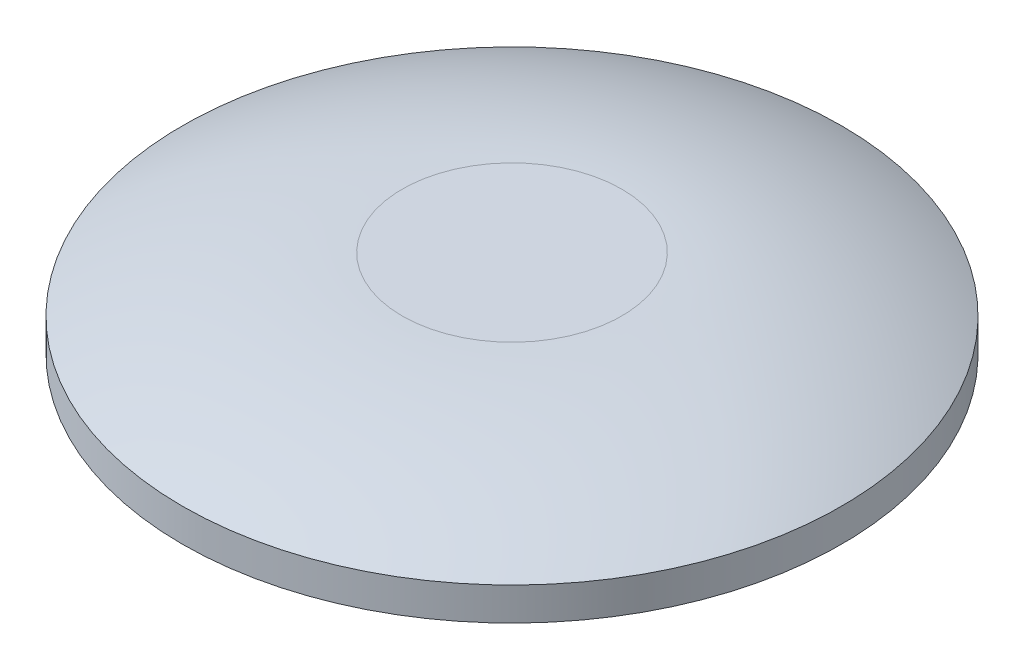
ISO-10303-21;
HEADER;
FILE_DESCRIPTION(('STEP AP214'),'2;1');
FILE_NAME('part.step','',(''),(''),'','','');
FILE_SCHEMA(('AUTOMOTIVE_DESIGN { 1 0 10303 214 1 1 1 1 }'));
ENDSEC;
DATA;
#1=APPLICATION_CONTEXT('core data for automotive mechanical design processes');
#2=APPLICATION_PROTOCOL_DEFINITION('international standard','automotive_design',2000,#1);
#3=PRODUCT_CONTEXT('',#1,'mechanical');
#4=PRODUCT('Part','Part','',(#3));
#5=PRODUCT_RELATED_PRODUCT_CATEGORY('part','',(#4));
#6=PRODUCT_DEFINITION_FORMATION('','',#4);
#7=PRODUCT_DEFINITION_CONTEXT('part definition',#1,'design');
#8=PRODUCT_DEFINITION('design','',#6,#7);
#9=PRODUCT_DEFINITION_SHAPE('','',#8);
#10=(LENGTH_UNIT() NAMED_UNIT(*) SI_UNIT(.MILLI.,.METRE.));
#11=(NAMED_UNIT(*) PLANE_ANGLE_UNIT() SI_UNIT($,.RADIAN.));
#12=(NAMED_UNIT(*) SI_UNIT($,.STERADIAN.) SOLID_ANGLE_UNIT());
#13=UNCERTAINTY_MEASURE_WITH_UNIT(LENGTH_MEASURE(1.E-05),#10,'distance_accuracy_value','');
#14=(GEOMETRIC_REPRESENTATION_CONTEXT(3) GLOBAL_UNCERTAINTY_ASSIGNED_CONTEXT((#13)) GLOBAL_UNIT_ASSIGNED_CONTEXT((#10,
#11,#12)) REPRESENTATION_CONTEXT('',''));
#15=CARTESIAN_POINT('',(0.,0.,0.));
#16=DIRECTION('',(0.,0.,1.));
#17=DIRECTION('',(1.,0.,0.));
#18=AXIS2_PLACEMENT_3D('',#15,#16,#17);
#19=CARTESIAN_POINT('',(0.,5.,0.));
#20=DIRECTION('',(0.,1.,0.));
#21=DIRECTION('',(0.,0.,1.));
#22=AXIS2_PLACEMENT_3D('',#19,#20,#21);
#23=PLANE('',#22);
#24=CARTESIAN_POINT('',(0.,4.99999999999999,0.));
#25=DIRECTION('',(0.,-1.,0.));
#26=DIRECTION('',(0.,0.,-1.));
#27=AXIS2_PLACEMENT_3D('',#24,#25,#26);
#28=CIRCLE('',#27,5.);
#29=CARTESIAN_POINT('',(0.,4.99999999999999,-5.));
#30=VERTEX_POINT('',#29);
#31=EDGE_CURVE('E10',#30,#30,#28,.T.);
#32=ORIENTED_EDGE('',*,*,#31,.F.);
#33=EDGE_LOOP('',(#32));
#34=FACE_BOUND('',#33,.T.);
#35=ADVANCED_FACE('F31',(#34),#23,.T.);
#36=CARTESIAN_POINT('',(0.,-16.2500000000001,0.));
#37=DIRECTION('',(0.,-1.,0.));
#38=DIRECTION('',(0.,0.,-1.));
#39=AXIS2_PLACEMENT_3D('',#36,#37,#38);
#40=DEGENERATE_TOROIDAL_SURFACE('',#39,5.,21.2500000000001,.T.);
#41=ORIENTED_EDGE('',*,*,#31,.T.);
#42=EDGE_LOOP('',(#41));
#43=FACE_BOUND('',#42,.T.);
#44=CARTESIAN_POINT('',(0.,2.5,0.));
#45=DIRECTION('',(0.,-1.,0.));
#46=DIRECTION('',(0.,0.,-1.));
#47=AXIS2_PLACEMENT_3D('',#44,#45,#46);
#48=CIRCLE('',#47,15.);
#49=CARTESIAN_POINT('',(0.,2.5,-15.));
#50=VERTEX_POINT('',#49);
#51=EDGE_CURVE('E37',#50,#50,#48,.T.);
#52=ORIENTED_EDGE('',*,*,#51,.F.);
#53=EDGE_LOOP('',(#52));
#54=FACE_BOUND('',#53,.T.);
#55=ADVANCED_FACE('F70',(#43,#54),#40,.T.);
#56=CARTESIAN_POINT('',(0.,0.,0.));
#57=DIRECTION('',(0.,-1.,0.));
#58=DIRECTION('',(0.,0.,-1.));
#59=AXIS2_PLACEMENT_3D('',#56,#57,#58);
#60=CYLINDRICAL_SURFACE('',#59,15.);
#61=ORIENTED_EDGE('',*,*,#51,.T.);
#62=EDGE_LOOP('',(#61));
#63=FACE_BOUND('',#62,.T.);
#64=CARTESIAN_POINT('',(0.,1.,0.));
#65=DIRECTION('',(0.,-1.,0.));
#66=DIRECTION('',(0.,0.,-1.));
#67=AXIS2_PLACEMENT_3D('',#64,#65,#66);
#68=CIRCLE('',#67,15.);
#69=CARTESIAN_POINT('',(0.,1.,-15.));
#70=VERTEX_POINT('',#69);
#71=EDGE_CURVE('E41',#70,#70,#68,.T.);
#72=ORIENTED_EDGE('',*,*,#71,.F.);
#73=EDGE_LOOP('',(#72));
#74=FACE_BOUND('',#73,.T.);
#75=ADVANCED_FACE('F66',(#63,#74),#60,.T.);
#76=CARTESIAN_POINT('',(10.,1.,0.));
#77=DIRECTION('',(0.,-1.,0.));
#78=DIRECTION('',(0.,0.,-1.));
#79=AXIS2_PLACEMENT_3D('',#76,#77,#78);
#80=PLANE('',#79);
#81=ORIENTED_EDGE('',*,*,#71,.T.);
#82=EDGE_LOOP('',(#81));
#83=FACE_BOUND('',#82,.T.);
#84=CARTESIAN_POINT('',(0.,1.,0.));
#85=DIRECTION('',(0.,-1.,0.));
#86=DIRECTION('',(0.,0.,-1.));
#87=AXIS2_PLACEMENT_3D('',#84,#85,#86);
#88=CIRCLE('',#87,10.);
#89=CARTESIAN_POINT('',(0.,1.,-10.));
#90=VERTEX_POINT('',#89);
#91=EDGE_CURVE('E45',#90,#90,#88,.T.);
#92=ORIENTED_EDGE('',*,*,#91,.F.);
#93=EDGE_LOOP('',(#92));
#94=FACE_BOUND('',#93,.T.);
#95=ADVANCED_FACE('F58',(#83,#94),#80,.T.);
#96=CARTESIAN_POINT('',(0.,0.,0.));
#97=DIRECTION('',(0.,-1.,0.));
#98=DIRECTION('',(0.,0.,-1.));
#99=AXIS2_PLACEMENT_3D('',#96,#97,#98);
#100=CYLINDRICAL_SURFACE('',#99,10.);
#101=ORIENTED_EDGE('',*,*,#91,.T.);
#102=EDGE_LOOP('',(#101));
#103=FACE_BOUND('',#102,.T.);
#104=CARTESIAN_POINT('',(0.,0.,0.));
#105=DIRECTION('',(0.,-1.,0.));
#106=DIRECTION('',(0.,0.,-1.));
#107=AXIS2_PLACEMENT_3D('',#104,#105,#106);
#108=CIRCLE('',#107,10.);
#109=CARTESIAN_POINT('',(0.,0.,-10.));
#110=VERTEX_POINT('',#109);
#111=EDGE_CURVE('E50',#110,#110,#108,.T.);
#112=ORIENTED_EDGE('',*,*,#111,.F.);
#113=EDGE_LOOP('',(#112));
#114=FACE_BOUND('',#113,.T.);
#115=ADVANCED_FACE('F56',(#103,#114),#100,.T.);
#116=CARTESIAN_POINT('',(0.,0.,0.));
#117=DIRECTION('',(0.,-1.,0.));
#118=DIRECTION('',(0.,0.,-1.));
#119=AXIS2_PLACEMENT_3D('',#116,#117,#118);
#120=PLANE('',#119);
#121=ORIENTED_EDGE('',*,*,#111,.T.);
#122=EDGE_LOOP('',(#121));
#123=FACE_BOUND('',#122,.T.);
#124=ADVANCED_FACE('F54',(#123),#120,.T.);
#125=CLOSED_SHELL('',(#35,#55,#75,#95,#115,#124));
#126=MANIFOLD_SOLID_BREP('B2',#125);
#127=ADVANCED_BREP_SHAPE_REPRESENTATION('',(#18,#126),#14);
#128=SHAPE_DEFINITION_REPRESENTATION(#9,#127);
ENDSEC;
END-ISO-10303-21;
